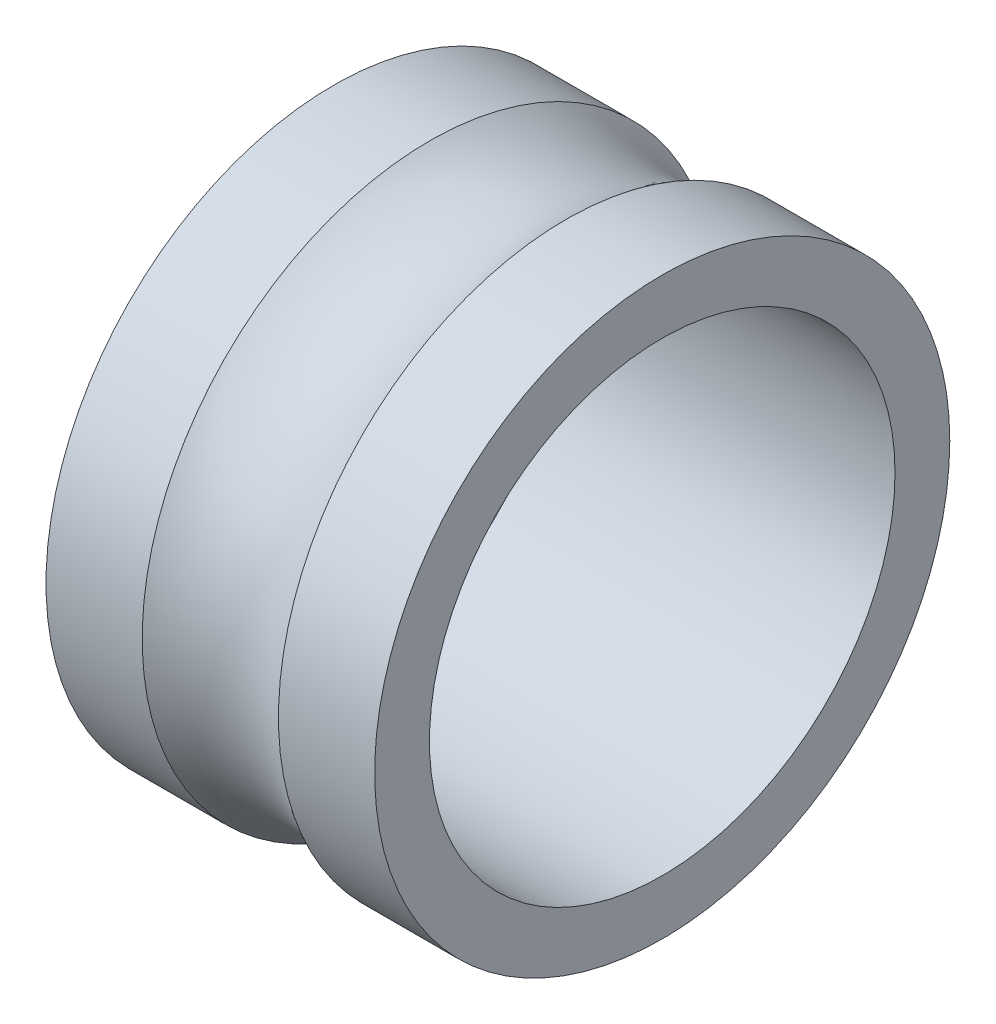
ISO-10303-21;
HEADER;
FILE_DESCRIPTION(('STEP AP214'),'2;1');
FILE_NAME('part.step','',(''),(''),'','','');
FILE_SCHEMA(('AUTOMOTIVE_DESIGN { 1 0 10303 214 1 1 1 1 }'));
ENDSEC;
DATA;
#1=APPLICATION_CONTEXT('core data for automotive mechanical design processes');
#2=APPLICATION_PROTOCOL_DEFINITION('international standard','automotive_design',2000,#1);
#3=PRODUCT_CONTEXT('',#1,'mechanical');
#4=PRODUCT('Part','Part','',(#3));
#5=PRODUCT_RELATED_PRODUCT_CATEGORY('part','',(#4));
#6=PRODUCT_DEFINITION_FORMATION('','',#4);
#7=PRODUCT_DEFINITION_CONTEXT('part definition',#1,'design');
#8=PRODUCT_DEFINITION('design','',#6,#7);
#9=PRODUCT_DEFINITION_SHAPE('','',#8);
#10=(LENGTH_UNIT() NAMED_UNIT(*) SI_UNIT(.MILLI.,.METRE.));
#11=(NAMED_UNIT(*) PLANE_ANGLE_UNIT() SI_UNIT($,.RADIAN.));
#12=(NAMED_UNIT(*) SI_UNIT($,.STERADIAN.) SOLID_ANGLE_UNIT());
#13=UNCERTAINTY_MEASURE_WITH_UNIT(LENGTH_MEASURE(1.E-05),#10,'distance_accuracy_value','');
#14=(GEOMETRIC_REPRESENTATION_CONTEXT(3) GLOBAL_UNCERTAINTY_ASSIGNED_CONTEXT((#13)) GLOBAL_UNIT_ASSIGNED_CONTEXT((#10,
#11,#12)) REPRESENTATION_CONTEXT('',''));
#15=CARTESIAN_POINT('',(0.,0.,0.));
#16=DIRECTION('',(0.,0.,1.));
#17=DIRECTION('',(1.,0.,0.));
#18=AXIS2_PLACEMENT_3D('',#15,#16,#17);
#19=CARTESIAN_POINT('',(6.,-5.75,0.));
#20=DIRECTION('',(1.,0.,0.));
#21=DIRECTION('',(0.,0.,-1.));
#22=AXIS2_PLACEMENT_3D('',#19,#20,#21);
#23=PLANE('',#22);
#24=CARTESIAN_POINT('',(6.,-14.25,0.));
#25=DIRECTION('',(1.,0.,0.));
#26=DIRECTION('',(0.,0.,-1.));
#27=AXIS2_PLACEMENT_3D('',#24,#25,#26);
#28=CIRCLE('',#27,10.5);
#29=CARTESIAN_POINT('',(6.,-14.25,-10.5));
#30=VERTEX_POINT('',#29);
#31=EDGE_CURVE('E10',#30,#30,#28,.T.);
#32=ORIENTED_EDGE('',*,*,#31,.T.);
#33=EDGE_LOOP('',(#32));
#34=FACE_BOUND('',#33,.T.);
#35=CARTESIAN_POINT('',(6.,-14.25,0.));
#36=DIRECTION('',(1.,0.,0.));
#37=DIRECTION('',(0.,0.,-1.));
#38=AXIS2_PLACEMENT_3D('',#35,#36,#37);
#39=CIRCLE('',#38,8.5);
#40=CARTESIAN_POINT('',(6.,-14.25,-8.5));
#41=VERTEX_POINT('',#40);
#42=EDGE_CURVE('E64',#41,#41,#39,.T.);
#43=ORIENTED_EDGE('',*,*,#42,.F.);
#44=EDGE_LOOP('',(#43));
#45=FACE_BOUND('',#44,.T.);
#46=ADVANCED_FACE('F37',(#34,#45),#23,.T.);
#47=CARTESIAN_POINT('',(0.,-14.25,0.));
#48=DIRECTION('',(1.,0.,0.));
#49=DIRECTION('',(0.,0.,-1.));
#50=AXIS2_PLACEMENT_3D('',#47,#48,#49);
#51=CYLINDRICAL_SURFACE('',#50,10.5);
#52=CARTESIAN_POINT('',(2.48746859276655,-14.25,0.));
#53=DIRECTION('',(1.,0.,0.));
#54=DIRECTION('',(0.,0.,-1.));
#55=AXIS2_PLACEMENT_3D('',#52,#53,#54);
#56=CIRCLE('',#55,10.5);
#57=CARTESIAN_POINT('',(2.48746859276655,-14.25,-10.5));
#58=VERTEX_POINT('',#57);
#59=EDGE_CURVE('E44',#58,#58,#56,.T.);
#60=ORIENTED_EDGE('',*,*,#59,.T.);
#61=EDGE_LOOP('',(#60));
#62=FACE_BOUND('',#61,.T.);
#63=ORIENTED_EDGE('',*,*,#31,.F.);
#64=EDGE_LOOP('',(#63));
#65=FACE_BOUND('',#64,.T.);
#66=ADVANCED_FACE('F73',(#62,#65),#51,.T.);
#67=CARTESIAN_POINT('',(0.,-14.25,0.));
#68=DIRECTION('',(1.,0.,0.));
#69=DIRECTION('',(0.,0.,-1.));
#70=AXIS2_PLACEMENT_3D('',#67,#68,#69);
#71=TOROIDAL_SURFACE('',#70,14.25,4.5);
#72=CARTESIAN_POINT('',(-2.48746859276655,-14.25,0.));
#73=DIRECTION('',(1.,0.,0.));
#74=DIRECTION('',(0.,0.,-1.));
#75=AXIS2_PLACEMENT_3D('',#72,#73,#74);
#76=CIRCLE('',#75,10.5);
#77=CARTESIAN_POINT('',(-2.48746859276655,-14.25,-10.5));
#78=VERTEX_POINT('',#77);
#79=EDGE_CURVE('E49',#78,#78,#76,.T.);
#80=ORIENTED_EDGE('',*,*,#79,.T.);
#81=EDGE_LOOP('',(#80));
#82=FACE_BOUND('',#81,.T.);
#83=ORIENTED_EDGE('',*,*,#59,.F.);
#84=EDGE_LOOP('',(#83));
#85=FACE_BOUND('',#84,.T.);
#86=ADVANCED_FACE('F77',(#82,#85),#71,.F.);
#87=CARTESIAN_POINT('',(0.,-14.25,0.));
#88=DIRECTION('',(1.,0.,0.));
#89=DIRECTION('',(0.,0.,-1.));
#90=AXIS2_PLACEMENT_3D('',#87,#88,#89);
#91=CYLINDRICAL_SURFACE('',#90,10.5);
#92=CARTESIAN_POINT('',(-6.,-14.25,0.));
#93=DIRECTION('',(1.,0.,0.));
#94=DIRECTION('',(0.,0.,-1.));
#95=AXIS2_PLACEMENT_3D('',#92,#93,#94);
#96=CIRCLE('',#95,10.5);
#97=CARTESIAN_POINT('',(-6.,-14.25,-10.5));
#98=VERTEX_POINT('',#97);
#99=EDGE_CURVE('E54',#98,#98,#96,.T.);
#100=ORIENTED_EDGE('',*,*,#99,.T.);
#101=EDGE_LOOP('',(#100));
#102=FACE_BOUND('',#101,.T.);
#103=ORIENTED_EDGE('',*,*,#79,.F.);
#104=EDGE_LOOP('',(#103));
#105=FACE_BOUND('',#104,.T.);
#106=ADVANCED_FACE('F81',(#102,#105),#91,.T.);
#107=CARTESIAN_POINT('',(-6.,-5.75,0.));
#108=DIRECTION('',(-1.,0.,0.));
#109=DIRECTION('',(0.,0.,1.));
#110=AXIS2_PLACEMENT_3D('',#107,#108,#109);
#111=PLANE('',#110);
#112=CARTESIAN_POINT('',(-6.,-14.25,0.));
#113=DIRECTION('',(1.,0.,0.));
#114=DIRECTION('',(0.,0.,-1.));
#115=AXIS2_PLACEMENT_3D('',#112,#113,#114);
#116=CIRCLE('',#115,8.5);
#117=CARTESIAN_POINT('',(-6.,-14.25,-8.5));
#118=VERTEX_POINT('',#117);
#119=EDGE_CURVE('E60',#118,#118,#116,.T.);
#120=ORIENTED_EDGE('',*,*,#119,.T.);
#121=EDGE_LOOP('',(#120));
#122=FACE_BOUND('',#121,.T.);
#123=ORIENTED_EDGE('',*,*,#99,.F.);
#124=EDGE_LOOP('',(#123));
#125=FACE_BOUND('',#124,.T.);
#126=ADVANCED_FACE('F88',(#122,#125),#111,.T.);
#127=CARTESIAN_POINT('',(0.,-14.25,0.));
#128=DIRECTION('',(1.,0.,0.));
#129=DIRECTION('',(0.,0.,-1.));
#130=AXIS2_PLACEMENT_3D('',#127,#128,#129);
#131=CYLINDRICAL_SURFACE('',#130,8.5);
#132=ORIENTED_EDGE('',*,*,#42,.T.);
#133=EDGE_LOOP('',(#132));
#134=FACE_BOUND('',#133,.T.);
#135=ORIENTED_EDGE('',*,*,#119,.F.);
#136=EDGE_LOOP('',(#135));
#137=FACE_BOUND('',#136,.T.);
#138=ADVANCED_FACE('F69',(#134,#137),#131,.F.);
#139=CLOSED_SHELL('',(#46,#66,#86,#106,#126,#138));
#140=MANIFOLD_SOLID_BREP('B2',#139);
#141=ADVANCED_BREP_SHAPE_REPRESENTATION('',(#18,#140),#14);
#142=SHAPE_DEFINITION_REPRESENTATION(#9,#141);
ENDSEC;
END-ISO-10303-21;
